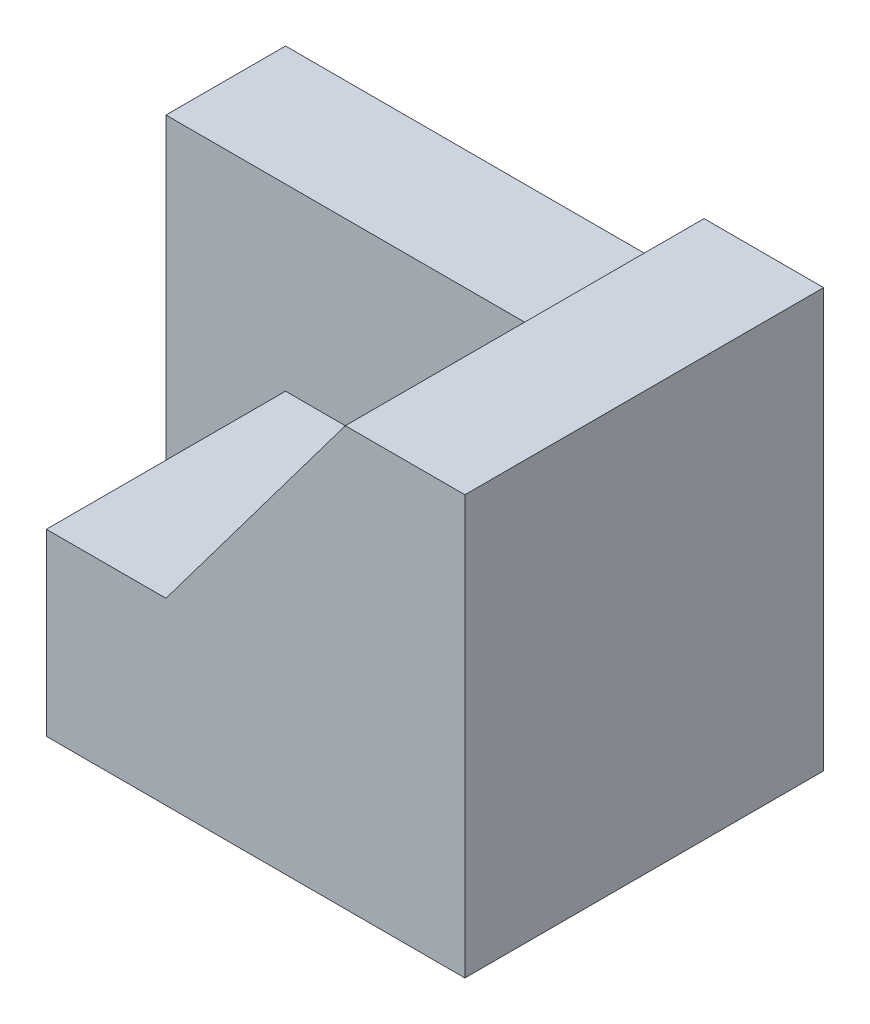
ISO-10303-21;
HEADER;
FILE_DESCRIPTION(('STEP AP214'),'2;1');
FILE_NAME('part.step','',(''),(''),'','','');
FILE_SCHEMA(('AUTOMOTIVE_DESIGN { 1 0 10303 214 1 1 1 1 }'));
ENDSEC;
DATA;
#1=APPLICATION_CONTEXT('core data for automotive mechanical design processes');
#2=APPLICATION_PROTOCOL_DEFINITION('international standard','automotive_design',2000,#1);
#3=PRODUCT_CONTEXT('',#1,'mechanical');
#4=PRODUCT('Part','Part','',(#3));
#5=PRODUCT_RELATED_PRODUCT_CATEGORY('part','',(#4));
#6=PRODUCT_DEFINITION_FORMATION('','',#4);
#7=PRODUCT_DEFINITION_CONTEXT('part definition',#1,'design');
#8=PRODUCT_DEFINITION('design','',#6,#7);
#9=PRODUCT_DEFINITION_SHAPE('','',#8);
#10=(LENGTH_UNIT() NAMED_UNIT(*) SI_UNIT(.MILLI.,.METRE.));
#11=(NAMED_UNIT(*) PLANE_ANGLE_UNIT() SI_UNIT($,.RADIAN.));
#12=(NAMED_UNIT(*) SI_UNIT($,.STERADIAN.) SOLID_ANGLE_UNIT());
#13=UNCERTAINTY_MEASURE_WITH_UNIT(LENGTH_MEASURE(1.E-05),#10,'distance_accuracy_value','');
#14=(GEOMETRIC_REPRESENTATION_CONTEXT(3) GLOBAL_UNCERTAINTY_ASSIGNED_CONTEXT((#13)) GLOBAL_UNIT_ASSIGNED_CONTEXT((#10,
#11,#12)) REPRESENTATION_CONTEXT('',''));
#15=CARTESIAN_POINT('',(0.,0.,0.));
#16=DIRECTION('',(0.,0.,1.));
#17=DIRECTION('',(1.,0.,0.));
#18=AXIS2_PLACEMENT_3D('',#15,#16,#17);
#19=CARTESIAN_POINT('',(0.,60.,20.));
#20=DIRECTION('',(0.,-1.,0.));
#21=DIRECTION('',(0.,0.,-1.));
#22=AXIS2_PLACEMENT_3D('',#19,#20,#21);
#23=PLANE('',#22);
#24=DIRECTION('',(0.,0.,1.));
#25=VECTOR('',#24,1.);
#26=CARTESIAN_POINT('',(62.5,60.,20.));
#27=LINE('',#26,#25);
#28=CARTESIAN_POINT('',(62.5,60.,0.));
#29=VERTEX_POINT('',#28);
#30=CARTESIAN_POINT('',(62.5,60.,20.));
#31=VERTEX_POINT('',#30);
#32=EDGE_CURVE('E155',#29,#31,#27,.T.);
#33=ORIENTED_EDGE('',*,*,#32,.F.);
#34=DIRECTION('',(-1.,0.,0.));
#35=VECTOR('',#34,1.);
#36=CARTESIAN_POINT('',(0.,60.,0.));
#37=LINE('',#36,#35);
#38=CARTESIAN_POINT('',(0.,60.,0.));
#39=VERTEX_POINT('',#38);
#40=EDGE_CURVE('E163',#29,#39,#37,.T.);
#41=ORIENTED_EDGE('',*,*,#40,.T.);
#42=DIRECTION('',(0.,0.,-1.));
#43=VECTOR('',#42,1.);
#44=CARTESIAN_POINT('',(0.,60.,20.));
#45=LINE('',#44,#43);
#46=CARTESIAN_POINT('',(0.,60.,20.));
#47=VERTEX_POINT('',#46);
#48=EDGE_CURVE('E112',#47,#39,#45,.T.);
#49=ORIENTED_EDGE('',*,*,#48,.F.);
#50=DIRECTION('',(-1.,0.,0.));
#51=VECTOR('',#50,1.);
#52=CARTESIAN_POINT('',(0.,60.,20.));
#53=LINE('',#52,#51);
#54=EDGE_CURVE('E165',#31,#47,#53,.T.);
#55=ORIENTED_EDGE('',*,*,#54,.F.);
#56=EDGE_LOOP('',(#33,#41,#49,#55));
#57=FACE_BOUND('',#56,.T.);
#58=ADVANCED_FACE('F35',(#57),#23,.F.);
#59=CARTESIAN_POINT('',(0.,0.,20.));
#60=DIRECTION('',(0.,0.,-1.));
#61=DIRECTION('',(-1.,0.,0.));
#62=AXIS2_PLACEMENT_3D('',#59,#60,#61);
#63=PLANE('',#62);
#64=DIRECTION('',(-0.6,-0.8,0.));
#65=VECTOR('',#64,1.);
#66=CARTESIAN_POINT('',(11.2,-8.39999999999999,20.));
#67=LINE('',#66,#65);
#68=CARTESIAN_POINT('',(40.,30.,20.));
#69=VERTEX_POINT('',#68);
#70=EDGE_CURVE('E153',#31,#69,#67,.T.);
#71=ORIENTED_EDGE('',*,*,#70,.F.);
#72=ORIENTED_EDGE('',*,*,#54,.T.);
#73=DIRECTION('',(0.,-1.,0.));
#74=VECTOR('',#73,1.);
#75=CARTESIAN_POINT('',(0.,0.,20.));
#76=LINE('',#75,#74);
#77=CARTESIAN_POINT('',(0.,0.,20.));
#78=VERTEX_POINT('',#77);
#79=EDGE_CURVE('E159',#47,#78,#76,.T.);
#80=ORIENTED_EDGE('',*,*,#79,.T.);
#81=DIRECTION('',(1.,0.,0.));
#82=VECTOR('',#81,1.);
#83=CARTESIAN_POINT('',(0.,0.,20.));
#84=LINE('',#83,#82);
#85=CARTESIAN_POINT('',(20.,0.,20.));
#86=VERTEX_POINT('',#85);
#87=EDGE_CURVE('E162',#78,#86,#84,.T.);
#88=ORIENTED_EDGE('',*,*,#87,.T.);
#89=DIRECTION('',(0.,-1.,0.));
#90=VECTOR('',#89,1.);
#91=CARTESIAN_POINT('',(20.,0.,20.));
#92=LINE('',#91,#90);
#93=CARTESIAN_POINT('',(20.,30.,20.));
#94=VERTEX_POINT('',#93);
#95=EDGE_CURVE('E55',#94,#86,#92,.T.);
#96=ORIENTED_EDGE('',*,*,#95,.F.);
#97=DIRECTION('',(-1.,0.,0.));
#98=VECTOR('',#97,1.);
#99=CARTESIAN_POINT('',(0.,30.,20.));
#100=LINE('',#99,#98);
#101=EDGE_CURVE('E50',#69,#94,#100,.T.);
#102=ORIENTED_EDGE('',*,*,#101,.F.);
#103=EDGE_LOOP('',(#71,#72,#80,#88,#96,#102));
#104=FACE_BOUND('',#103,.T.);
#105=ADVANCED_FACE('F186',(#104),#63,.F.);
#106=CARTESIAN_POINT('',(0.,0.,20.));
#107=DIRECTION('',(1.,0.,0.));
#108=DIRECTION('',(0.,0.,-1.));
#109=AXIS2_PLACEMENT_3D('',#106,#107,#108);
#110=PLANE('',#109);
#111=DIRECTION('',(0.,-1.,0.));
#112=VECTOR('',#111,1.);
#113=CARTESIAN_POINT('',(0.,0.,0.));
#114=LINE('',#113,#112);
#115=CARTESIAN_POINT('',(0.,0.,0.));
#116=VERTEX_POINT('',#115);
#117=EDGE_CURVE('E158',#39,#116,#114,.T.);
#118=ORIENTED_EDGE('',*,*,#117,.T.);
#119=DIRECTION('',(0.,0.,-1.));
#120=VECTOR('',#119,1.);
#121=CARTESIAN_POINT('',(0.,0.,20.));
#122=LINE('',#121,#120);
#123=EDGE_CURVE('E11',#78,#116,#122,.T.);
#124=ORIENTED_EDGE('',*,*,#123,.F.);
#125=ORIENTED_EDGE('',*,*,#79,.F.);
#126=ORIENTED_EDGE('',*,*,#48,.T.);
#127=EDGE_LOOP('',(#118,#124,#125,#126));
#128=FACE_BOUND('',#127,.T.);
#129=ADVANCED_FACE('F37',(#128),#110,.F.);
#130=CARTESIAN_POINT('',(0.,0.,20.));
#131=DIRECTION('',(0.,1.,0.));
#132=DIRECTION('',(0.,0.,1.));
#133=AXIS2_PLACEMENT_3D('',#130,#131,#132);
#134=PLANE('',#133);
#135=DIRECTION('',(0.,0.,-1.));
#136=VECTOR('',#135,1.);
#137=CARTESIAN_POINT('',(90.,0.,20.));
#138=LINE('',#137,#136);
#139=CARTESIAN_POINT('',(90.,0.,60.));
#140=VERTEX_POINT('',#139);
#141=CARTESIAN_POINT('',(90.,0.,0.));
#142=VERTEX_POINT('',#141);
#143=EDGE_CURVE('E43',#140,#142,#138,.T.);
#144=ORIENTED_EDGE('',*,*,#143,.F.);
#145=DIRECTION('',(1.,0.,0.));
#146=VECTOR('',#145,1.);
#147=CARTESIAN_POINT('',(90.,0.,60.));
#148=LINE('',#147,#146);
#149=CARTESIAN_POINT('',(20.,0.,60.));
#150=VERTEX_POINT('',#149);
#151=EDGE_CURVE('E108',#150,#140,#148,.T.);
#152=ORIENTED_EDGE('',*,*,#151,.F.);
#153=DIRECTION('',(0.,0.,-1.));
#154=VECTOR('',#153,1.);
#155=CARTESIAN_POINT('',(20.,0.,60.));
#156=LINE('',#155,#154);
#157=EDGE_CURVE('E138',#150,#86,#156,.T.);
#158=ORIENTED_EDGE('',*,*,#157,.T.);
#159=ORIENTED_EDGE('',*,*,#87,.F.);
#160=ORIENTED_EDGE('',*,*,#123,.T.);
#161=DIRECTION('',(1.,0.,0.));
#162=VECTOR('',#161,1.);
#163=CARTESIAN_POINT('',(0.,0.,0.));
#164=LINE('',#163,#162);
#165=EDGE_CURVE('E109',#116,#142,#164,.T.);
#166=ORIENTED_EDGE('',*,*,#165,.T.);
#167=EDGE_LOOP('',(#144,#152,#158,#159,#160,#166));
#168=FACE_BOUND('',#167,.T.);
#169=ADVANCED_FACE('F105',(#168),#134,.F.);
#170=CARTESIAN_POINT('',(90.,0.,20.));
#171=DIRECTION('',(-1.,0.,0.));
#172=DIRECTION('',(0.,0.,1.));
#173=AXIS2_PLACEMENT_3D('',#170,#171,#172);
#174=PLANE('',#173);
#175=DIRECTION('',(0.,1.,0.));
#176=VECTOR('',#175,1.);
#177=CARTESIAN_POINT('',(90.,0.,0.));
#178=LINE('',#177,#176);
#179=CARTESIAN_POINT('',(90.,70.,0.));
#180=VERTEX_POINT('',#179);
#181=EDGE_CURVE('E170',#142,#180,#178,.T.);
#182=ORIENTED_EDGE('',*,*,#181,.T.);
#183=DIRECTION('',(0.,0.,-1.));
#184=VECTOR('',#183,1.);
#185=CARTESIAN_POINT('',(90.,70.,60.));
#186=LINE('',#185,#184);
#187=CARTESIAN_POINT('',(90.,70.,60.));
#188=VERTEX_POINT('',#187);
#189=EDGE_CURVE('E117',#188,#180,#186,.T.);
#190=ORIENTED_EDGE('',*,*,#189,.F.);
#191=DIRECTION('',(0.,1.,0.));
#192=VECTOR('',#191,1.);
#193=CARTESIAN_POINT('',(90.,70.,60.));
#194=LINE('',#193,#192);
#195=EDGE_CURVE('E114',#140,#188,#194,.T.);
#196=ORIENTED_EDGE('',*,*,#195,.F.);
#197=ORIENTED_EDGE('',*,*,#143,.T.);
#198=EDGE_LOOP('',(#182,#190,#196,#197));
#199=FACE_BOUND('',#198,.T.);
#200=ADVANCED_FACE('F115',(#199),#174,.F.);
#201=CARTESIAN_POINT('',(0.,0.,0.));
#202=DIRECTION('',(0.,0.,-1.));
#203=DIRECTION('',(-1.,0.,0.));
#204=AXIS2_PLACEMENT_3D('',#201,#202,#203);
#205=PLANE('',#204);
#206=ORIENTED_EDGE('',*,*,#40,.F.);
#207=DIRECTION('',(-0.6,-0.8,0.));
#208=VECTOR('',#207,1.);
#209=CARTESIAN_POINT('',(40.,30.,0.));
#210=LINE('',#209,#208);
#211=CARTESIAN_POINT('',(70.,70.,0.));
#212=VERTEX_POINT('',#211);
#213=EDGE_CURVE('E126',#212,#29,#210,.T.);
#214=ORIENTED_EDGE('',*,*,#213,.F.);
#215=DIRECTION('',(-1.,0.,0.));
#216=VECTOR('',#215,1.);
#217=CARTESIAN_POINT('',(70.,70.,0.));
#218=LINE('',#217,#216);
#219=EDGE_CURVE('E129',#180,#212,#218,.T.);
#220=ORIENTED_EDGE('',*,*,#219,.F.);
#221=ORIENTED_EDGE('',*,*,#181,.F.);
#222=ORIENTED_EDGE('',*,*,#165,.F.);
#223=ORIENTED_EDGE('',*,*,#117,.F.);
#224=EDGE_LOOP('',(#206,#214,#220,#221,#222,#223));
#225=FACE_BOUND('',#224,.T.);
#226=ADVANCED_FACE('F183',(#225),#205,.T.);
#227=CARTESIAN_POINT('',(40.,30.,60.));
#228=DIRECTION('',(0.8,-0.6,0.));
#229=DIRECTION('',(0.6,0.8,0.));
#230=AXIS2_PLACEMENT_3D('',#227,#228,#229);
#231=PLANE('',#230);
#232=ORIENTED_EDGE('',*,*,#213,.T.);
#233=ORIENTED_EDGE('',*,*,#32,.T.);
#234=ORIENTED_EDGE('',*,*,#70,.T.);
#235=DIRECTION('',(0.,0.,-1.));
#236=VECTOR('',#235,1.);
#237=CARTESIAN_POINT('',(40.,30.,60.));
#238=LINE('',#237,#236);
#239=CARTESIAN_POINT('',(40.,30.,60.));
#240=VERTEX_POINT('',#239);
#241=EDGE_CURVE('E144',#240,#69,#238,.T.);
#242=ORIENTED_EDGE('',*,*,#241,.F.);
#243=DIRECTION('',(-0.6,-0.8,0.));
#244=VECTOR('',#243,1.);
#245=CARTESIAN_POINT('',(40.,30.,60.));
#246=LINE('',#245,#244);
#247=CARTESIAN_POINT('',(70.,70.,60.));
#248=VERTEX_POINT('',#247);
#249=EDGE_CURVE('E133',#248,#240,#246,.T.);
#250=ORIENTED_EDGE('',*,*,#249,.F.);
#251=DIRECTION('',(0.,0.,-1.));
#252=VECTOR('',#251,1.);
#253=CARTESIAN_POINT('',(70.,70.,60.));
#254=LINE('',#253,#252);
#255=EDGE_CURVE('E147',#248,#212,#254,.T.);
#256=ORIENTED_EDGE('',*,*,#255,.T.);
#257=EDGE_LOOP('',(#232,#233,#234,#242,#250,#256));
#258=FACE_BOUND('',#257,.T.);
#259=ADVANCED_FACE('F188',(#258),#231,.F.);
#260=CARTESIAN_POINT('',(20.,30.,60.));
#261=DIRECTION('',(0.,-1.,0.));
#262=DIRECTION('',(0.,0.,-1.));
#263=AXIS2_PLACEMENT_3D('',#260,#261,#262);
#264=PLANE('',#263);
#265=ORIENTED_EDGE('',*,*,#241,.T.);
#266=ORIENTED_EDGE('',*,*,#101,.T.);
#267=DIRECTION('',(0.,0.,-1.));
#268=VECTOR('',#267,1.);
#269=CARTESIAN_POINT('',(20.,30.,60.));
#270=LINE('',#269,#268);
#271=CARTESIAN_POINT('',(20.,30.,60.));
#272=VERTEX_POINT('',#271);
#273=EDGE_CURVE('E141',#272,#94,#270,.T.);
#274=ORIENTED_EDGE('',*,*,#273,.F.);
#275=DIRECTION('',(-1.,0.,0.));
#276=VECTOR('',#275,1.);
#277=CARTESIAN_POINT('',(20.,30.,60.));
#278=LINE('',#277,#276);
#279=EDGE_CURVE('E135',#240,#272,#278,.T.);
#280=ORIENTED_EDGE('',*,*,#279,.F.);
#281=EDGE_LOOP('',(#265,#266,#274,#280));
#282=FACE_BOUND('',#281,.T.);
#283=ADVANCED_FACE('F197',(#282),#264,.F.);
#284=CARTESIAN_POINT('',(20.,0.,60.));
#285=DIRECTION('',(1.,0.,0.));
#286=DIRECTION('',(0.,0.,-1.));
#287=AXIS2_PLACEMENT_3D('',#284,#285,#286);
#288=PLANE('',#287);
#289=ORIENTED_EDGE('',*,*,#273,.T.);
#290=ORIENTED_EDGE('',*,*,#95,.T.);
#291=ORIENTED_EDGE('',*,*,#157,.F.);
#292=DIRECTION('',(0.,-1.,0.));
#293=VECTOR('',#292,1.);
#294=CARTESIAN_POINT('',(20.,0.,60.));
#295=LINE('',#294,#293);
#296=EDGE_CURVE('E124',#272,#150,#295,.T.);
#297=ORIENTED_EDGE('',*,*,#296,.F.);
#298=EDGE_LOOP('',(#289,#290,#291,#297));
#299=FACE_BOUND('',#298,.T.);
#300=ADVANCED_FACE('F199',(#299),#288,.F.);
#301=CARTESIAN_POINT('',(70.,70.,60.));
#302=DIRECTION('',(0.,-1.,0.));
#303=DIRECTION('',(0.,0.,-1.));
#304=AXIS2_PLACEMENT_3D('',#301,#302,#303);
#305=PLANE('',#304);
#306=ORIENTED_EDGE('',*,*,#219,.T.);
#307=ORIENTED_EDGE('',*,*,#255,.F.);
#308=DIRECTION('',(-1.,0.,0.));
#309=VECTOR('',#308,1.);
#310=CARTESIAN_POINT('',(70.,70.,60.));
#311=LINE('',#310,#309);
#312=EDGE_CURVE('E120',#188,#248,#311,.T.);
#313=ORIENTED_EDGE('',*,*,#312,.F.);
#314=ORIENTED_EDGE('',*,*,#189,.T.);
#315=EDGE_LOOP('',(#306,#307,#313,#314));
#316=FACE_BOUND('',#315,.T.);
#317=ADVANCED_FACE('F193',(#316),#305,.F.);
#318=CARTESIAN_POINT('',(0.,0.,60.));
#319=DIRECTION('',(0.,0.,-1.));
#320=DIRECTION('',(-1.,0.,0.));
#321=AXIS2_PLACEMENT_3D('',#318,#319,#320);
#322=PLANE('',#321);
#323=ORIENTED_EDGE('',*,*,#151,.T.);
#324=ORIENTED_EDGE('',*,*,#195,.T.);
#325=ORIENTED_EDGE('',*,*,#312,.T.);
#326=ORIENTED_EDGE('',*,*,#249,.T.);
#327=ORIENTED_EDGE('',*,*,#279,.T.);
#328=ORIENTED_EDGE('',*,*,#296,.T.);
#329=EDGE_LOOP('',(#323,#324,#325,#326,#327,#328));
#330=FACE_BOUND('',#329,.T.);
#331=ADVANCED_FACE('F122',(#330),#322,.F.);
#332=CLOSED_SHELL('',(#58,#105,#129,#169,#200,#226,#259,#283,#300,#317,#331));
#333=MANIFOLD_SOLID_BREP('B2',#332);
#334=ADVANCED_BREP_SHAPE_REPRESENTATION('',(#18,#333),#14);
#335=SHAPE_DEFINITION_REPRESENTATION(#9,#334);
ENDSEC;
END-ISO-10303-21;
